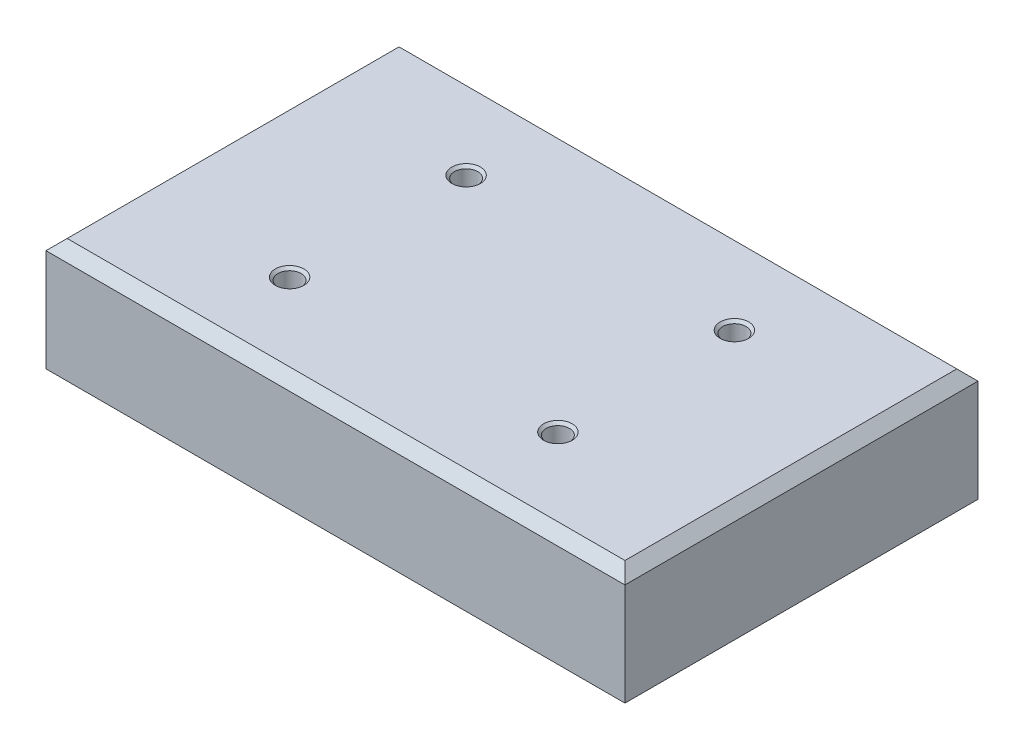
ISO-10303-21;
HEADER;
FILE_DESCRIPTION(('STEP AP214'),'2;1');
FILE_NAME('part.step','',(''),(''),'','','');
FILE_SCHEMA(('AUTOMOTIVE_DESIGN { 1 0 10303 214 1 1 1 1 }'));
ENDSEC;
DATA;
#1=APPLICATION_CONTEXT('core data for automotive mechanical design processes');
#2=APPLICATION_PROTOCOL_DEFINITION('international standard','automotive_design',2000,#1);
#3=PRODUCT_CONTEXT('',#1,'mechanical');
#4=PRODUCT('Part','Part','',(#3));
#5=PRODUCT_RELATED_PRODUCT_CATEGORY('part','',(#4));
#6=PRODUCT_DEFINITION_FORMATION('','',#4);
#7=PRODUCT_DEFINITION_CONTEXT('part definition',#1,'design');
#8=PRODUCT_DEFINITION('design','',#6,#7);
#9=PRODUCT_DEFINITION_SHAPE('','',#8);
#10=(LENGTH_UNIT() NAMED_UNIT(*) SI_UNIT(.MILLI.,.METRE.));
#11=(NAMED_UNIT(*) PLANE_ANGLE_UNIT() SI_UNIT($,.RADIAN.));
#12=(NAMED_UNIT(*) SI_UNIT($,.STERADIAN.) SOLID_ANGLE_UNIT());
#13=UNCERTAINTY_MEASURE_WITH_UNIT(LENGTH_MEASURE(1.E-05),#10,'distance_accuracy_value','');
#14=(GEOMETRIC_REPRESENTATION_CONTEXT(3) GLOBAL_UNCERTAINTY_ASSIGNED_CONTEXT((#13)) GLOBAL_UNIT_ASSIGNED_CONTEXT((#10,
#11,#12)) REPRESENTATION_CONTEXT('',''));
#15=CARTESIAN_POINT('',(0.,0.,0.));
#16=DIRECTION('',(0.,0.,1.));
#17=DIRECTION('',(1.,0.,0.));
#18=AXIS2_PLACEMENT_3D('',#15,#16,#17);
#19=CARTESIAN_POINT('',(0.,16.,0.));
#20=DIRECTION('',(1.,0.,0.));
#21=DIRECTION('',(0.,0.,-1.));
#22=AXIS2_PLACEMENT_3D('',#19,#20,#21);
#23=PLANE('',#22);
#24=DIRECTION('',(0.,-1.,0.));
#25=VECTOR('',#24,1.);
#26=CARTESIAN_POINT('',(0.,16.,0.));
#27=LINE('',#26,#25);
#28=CARTESIAN_POINT('',(0.,14.5,0.));
#29=VERTEX_POINT('',#28);
#30=CARTESIAN_POINT('',(0.,0.,0.));
#31=VERTEX_POINT('',#30);
#32=EDGE_CURVE('E175',#29,#31,#27,.T.);
#33=ORIENTED_EDGE('',*,*,#32,.F.);
#34=DIRECTION('',(0.,0.,-1.));
#35=VECTOR('',#34,1.);
#36=CARTESIAN_POINT('',(0.,14.5,0.));
#37=LINE('',#36,#35);
#38=CARTESIAN_POINT('',(0.,14.5,-50.));
#39=VERTEX_POINT('',#38);
#40=EDGE_CURVE('E186',#29,#39,#37,.T.);
#41=ORIENTED_EDGE('',*,*,#40,.T.);
#42=DIRECTION('',(0.,-1.,0.));
#43=VECTOR('',#42,1.);
#44=CARTESIAN_POINT('',(0.,16.,-50.));
#45=LINE('',#44,#43);
#46=CARTESIAN_POINT('',(0.,0.,-50.));
#47=VERTEX_POINT('',#46);
#48=EDGE_CURVE('E169',#39,#47,#45,.T.);
#49=ORIENTED_EDGE('',*,*,#48,.T.);
#50=DIRECTION('',(0.,0.,1.));
#51=VECTOR('',#50,1.);
#52=CARTESIAN_POINT('',(0.,0.,0.));
#53=LINE('',#52,#51);
#54=EDGE_CURVE('E157',#47,#31,#53,.T.);
#55=ORIENTED_EDGE('',*,*,#54,.T.);
#56=EDGE_LOOP('',(#33,#41,#49,#55));
#57=FACE_BOUND('',#56,.T.);
#58=ADVANCED_FACE('F47',(#57),#23,.F.);
#59=CARTESIAN_POINT('',(0.,16.,0.));
#60=DIRECTION('',(0.,0.,-1.));
#61=DIRECTION('',(-1.,0.,0.));
#62=AXIS2_PLACEMENT_3D('',#59,#60,#61);
#63=PLANE('',#62);
#64=DIRECTION('',(0.,-1.,0.));
#65=VECTOR('',#64,1.);
#66=CARTESIAN_POINT('',(82.,16.,0.));
#67=LINE('',#66,#65);
#68=CARTESIAN_POINT('',(82.,14.5,0.));
#69=VERTEX_POINT('',#68);
#70=CARTESIAN_POINT('',(82.,0.,0.));
#71=VERTEX_POINT('',#70);
#72=EDGE_CURVE('E173',#69,#71,#67,.T.);
#73=ORIENTED_EDGE('',*,*,#72,.F.);
#74=DIRECTION('',(-1.,0.,0.));
#75=VECTOR('',#74,1.);
#76=CARTESIAN_POINT('',(0.,14.5,0.));
#77=LINE('',#76,#75);
#78=EDGE_CURVE('E57',#69,#29,#77,.T.);
#79=ORIENTED_EDGE('',*,*,#78,.T.);
#80=ORIENTED_EDGE('',*,*,#32,.T.);
#81=DIRECTION('',(1.,0.,0.));
#82=VECTOR('',#81,1.);
#83=CARTESIAN_POINT('',(0.,0.,0.));
#84=LINE('',#83,#82);
#85=EDGE_CURVE('E160',#31,#71,#84,.T.);
#86=ORIENTED_EDGE('',*,*,#85,.T.);
#87=EDGE_LOOP('',(#73,#79,#80,#86));
#88=FACE_BOUND('',#87,.T.);
#89=ADVANCED_FACE('F211',(#88),#63,.F.);
#90=CARTESIAN_POINT('',(82.,16.,0.));
#91=DIRECTION('',(-1.,0.,0.));
#92=DIRECTION('',(0.,0.,1.));
#93=AXIS2_PLACEMENT_3D('',#90,#91,#92);
#94=PLANE('',#93);
#95=DIRECTION('',(0.,-1.,0.));
#96=VECTOR('',#95,1.);
#97=CARTESIAN_POINT('',(82.,16.,-50.));
#98=LINE('',#97,#96);
#99=CARTESIAN_POINT('',(82.,14.5,-50.));
#100=VERTEX_POINT('',#99);
#101=CARTESIAN_POINT('',(82.,0.,-50.));
#102=VERTEX_POINT('',#101);
#103=EDGE_CURVE('E171',#100,#102,#98,.T.);
#104=ORIENTED_EDGE('',*,*,#103,.F.);
#105=DIRECTION('',(0.,0.,1.));
#106=VECTOR('',#105,1.);
#107=CARTESIAN_POINT('',(82.,14.5,0.));
#108=LINE('',#107,#106);
#109=EDGE_CURVE('E11',#100,#69,#108,.T.);
#110=ORIENTED_EDGE('',*,*,#109,.T.);
#111=ORIENTED_EDGE('',*,*,#72,.T.);
#112=DIRECTION('',(0.,0.,-1.));
#113=VECTOR('',#112,1.);
#114=CARTESIAN_POINT('',(82.,0.,0.));
#115=LINE('',#114,#113);
#116=EDGE_CURVE('E163',#71,#102,#115,.T.);
#117=ORIENTED_EDGE('',*,*,#116,.T.);
#118=EDGE_LOOP('',(#104,#110,#111,#117));
#119=FACE_BOUND('',#118,.T.);
#120=ADVANCED_FACE('F234',(#119),#94,.F.);
#121=CARTESIAN_POINT('',(0.,16.,-50.));
#122=DIRECTION('',(0.,0.,1.));
#123=DIRECTION('',(1.,0.,0.));
#124=AXIS2_PLACEMENT_3D('',#121,#122,#123);
#125=PLANE('',#124);
#126=ORIENTED_EDGE('',*,*,#48,.F.);
#127=DIRECTION('',(1.,0.,0.));
#128=VECTOR('',#127,1.);
#129=CARTESIAN_POINT('',(0.,14.5,-50.));
#130=LINE('',#129,#128);
#131=EDGE_CURVE('E71',#39,#100,#130,.T.);
#132=ORIENTED_EDGE('',*,*,#131,.T.);
#133=ORIENTED_EDGE('',*,*,#103,.T.);
#134=DIRECTION('',(-1.,0.,0.));
#135=VECTOR('',#134,1.);
#136=CARTESIAN_POINT('',(0.,0.,-50.));
#137=LINE('',#136,#135);
#138=EDGE_CURVE('E166',#102,#47,#137,.T.);
#139=ORIENTED_EDGE('',*,*,#138,.T.);
#140=EDGE_LOOP('',(#126,#132,#133,#139));
#141=FACE_BOUND('',#140,.T.);
#142=ADVANCED_FACE('F223',(#141),#125,.F.);
#143=CARTESIAN_POINT('',(0.,16.,0.));
#144=DIRECTION('',(0.,-1.,0.));
#145=DIRECTION('',(0.,0.,-1.));
#146=AXIS2_PLACEMENT_3D('',#143,#144,#145);
#147=PLANE('',#146);
#148=CARTESIAN_POINT('',(22.,16.,-37.5));
#149=DIRECTION('',(0.,1.,0.));
#150=DIRECTION('',(0.,0.,1.));
#151=AXIS2_PLACEMENT_3D('',#148,#149,#150);
#152=CIRCLE('',#151,2.025);
#153=CARTESIAN_POINT('',(22.,16.,-35.475));
#154=VERTEX_POINT('',#153);
#155=EDGE_CURVE('E129',#154,#154,#152,.T.);
#156=ORIENTED_EDGE('',*,*,#155,.F.);
#157=EDGE_LOOP('',(#156));
#158=FACE_BOUND('',#157,.T.);
#159=CARTESIAN_POINT('',(22.,16.,-12.5));
#160=DIRECTION('',(0.,1.,0.));
#161=DIRECTION('',(0.,0.,1.));
#162=AXIS2_PLACEMENT_3D('',#159,#160,#161);
#163=CIRCLE('',#162,2.025);
#164=CARTESIAN_POINT('',(22.,16.,-10.475));
#165=VERTEX_POINT('',#164);
#166=EDGE_CURVE('E122',#165,#165,#163,.T.);
#167=ORIENTED_EDGE('',*,*,#166,.F.);
#168=EDGE_LOOP('',(#167));
#169=FACE_BOUND('',#168,.T.);
#170=CARTESIAN_POINT('',(60.,16.,-37.5));
#171=DIRECTION('',(0.,1.,0.));
#172=DIRECTION('',(0.,0.,1.));
#173=AXIS2_PLACEMENT_3D('',#170,#171,#172);
#174=CIRCLE('',#173,2.025);
#175=CARTESIAN_POINT('',(60.,16.,-35.475));
#176=VERTEX_POINT('',#175);
#177=EDGE_CURVE('E138',#176,#176,#174,.T.);
#178=ORIENTED_EDGE('',*,*,#177,.F.);
#179=EDGE_LOOP('',(#178));
#180=FACE_BOUND('',#179,.T.);
#181=CARTESIAN_POINT('',(60.,16.,-12.5));
#182=DIRECTION('',(0.,1.,0.));
#183=DIRECTION('',(0.,0.,1.));
#184=AXIS2_PLACEMENT_3D('',#181,#182,#183);
#185=CIRCLE('',#184,2.025);
#186=CARTESIAN_POINT('',(60.,16.,-10.475));
#187=VERTEX_POINT('',#186);
#188=EDGE_CURVE('E147',#187,#187,#185,.T.);
#189=ORIENTED_EDGE('',*,*,#188,.F.);
#190=EDGE_LOOP('',(#189));
#191=FACE_BOUND('',#190,.T.);
#192=DIRECTION('',(-1.,0.,0.));
#193=VECTOR('',#192,1.);
#194=CARTESIAN_POINT('',(0.,16.,-48.5));
#195=LINE('',#194,#193);
#196=CARTESIAN_POINT('',(80.5,16.,-48.5));
#197=VERTEX_POINT('',#196);
#198=CARTESIAN_POINT('',(1.50000000000001,16.,-48.5));
#199=VERTEX_POINT('',#198);
#200=EDGE_CURVE('E181',#197,#199,#195,.T.);
#201=ORIENTED_EDGE('',*,*,#200,.T.);
#202=DIRECTION('',(0.,0.,1.));
#203=VECTOR('',#202,1.);
#204=CARTESIAN_POINT('',(1.50000000000002,16.,0.));
#205=LINE('',#204,#203);
#206=CARTESIAN_POINT('',(1.50000000000002,16.,-1.50000000000002));
#207=VERTEX_POINT('',#206);
#208=EDGE_CURVE('E183',#199,#207,#205,.T.);
#209=ORIENTED_EDGE('',*,*,#208,.T.);
#210=DIRECTION('',(1.,0.,0.));
#211=VECTOR('',#210,1.);
#212=CARTESIAN_POINT('',(0.,16.,-1.50000000000002));
#213=LINE('',#212,#211);
#214=CARTESIAN_POINT('',(80.5,16.,-1.50000000000002));
#215=VERTEX_POINT('',#214);
#216=EDGE_CURVE('E179',#207,#215,#213,.T.);
#217=ORIENTED_EDGE('',*,*,#216,.T.);
#218=DIRECTION('',(0.,0.,-1.));
#219=VECTOR('',#218,1.);
#220=CARTESIAN_POINT('',(80.5,16.,0.));
#221=LINE('',#220,#219);
#222=EDGE_CURVE('E177',#215,#197,#221,.T.);
#223=ORIENTED_EDGE('',*,*,#222,.T.);
#224=EDGE_LOOP('',(#201,#209,#217,#223));
#225=FACE_BOUND('',#224,.T.);
#226=ADVANCED_FACE('F220',(#158,#169,#180,#191,#225),#147,.F.);
#227=CARTESIAN_POINT('',(0.,0.,0.));
#228=DIRECTION('',(0.,-1.,0.));
#229=DIRECTION('',(0.,0.,-1.));
#230=AXIS2_PLACEMENT_3D('',#227,#228,#229);
#231=PLANE('',#230);
#232=ORIENTED_EDGE('',*,*,#54,.F.);
#233=ORIENTED_EDGE('',*,*,#138,.F.);
#234=ORIENTED_EDGE('',*,*,#116,.F.);
#235=ORIENTED_EDGE('',*,*,#85,.F.);
#236=EDGE_LOOP('',(#232,#233,#234,#235));
#237=FACE_BOUND('',#236,.T.);
#238=ADVANCED_FACE('F222',(#237),#231,.T.);
#239=CARTESIAN_POINT('',(80.5,16.,0.));
#240=DIRECTION('',(-0.707106781186544,-0.707106781186551,0.));
#241=DIRECTION('',(0.,0.,-1.));
#242=AXIS2_PLACEMENT_3D('',#239,#240,#241);
#243=PLANE('',#242);
#244=DIRECTION('',(0.577350269189628,-0.577350269189622,0.577350269189628));
#245=VECTOR('',#244,1.);
#246=CARTESIAN_POINT('',(81.,15.5,-1.00000000000001));
#247=LINE('',#246,#245);
#248=EDGE_CURVE('E193',#69,#215,#247,.F.);
#249=ORIENTED_EDGE('',*,*,#248,.F.);
#250=ORIENTED_EDGE('',*,*,#109,.F.);
#251=DIRECTION('',(-0.577350269189628,0.577350269189622,0.577350269189628));
#252=VECTOR('',#251,1.);
#253=CARTESIAN_POINT('',(64.3333333333332,32.1666666666666,-32.3333333333332));
#254=LINE('',#253,#252);
#255=EDGE_CURVE('E52',#197,#100,#254,.F.);
#256=ORIENTED_EDGE('',*,*,#255,.F.);
#257=ORIENTED_EDGE('',*,*,#222,.F.);
#258=EDGE_LOOP('',(#249,#250,#256,#257));
#259=FACE_BOUND('',#258,.T.);
#260=ADVANCED_FACE('F50',(#259),#243,.F.);
#261=CARTESIAN_POINT('',(0.,16.,-48.5));
#262=DIRECTION('',(0.,-0.707106781186551,0.707106781186544));
#263=DIRECTION('',(-1.,0.,0.));
#264=AXIS2_PLACEMENT_3D('',#261,#262,#263);
#265=PLANE('',#264);
#266=ORIENTED_EDGE('',*,*,#255,.T.);
#267=ORIENTED_EDGE('',*,*,#131,.F.);
#268=DIRECTION('',(0.577350269189628,0.577350269189622,0.577350269189628));
#269=VECTOR('',#268,1.);
#270=CARTESIAN_POINT('',(1.,15.5,-49.));
#271=LINE('',#270,#269);
#272=EDGE_CURVE('E192',#199,#39,#271,.F.);
#273=ORIENTED_EDGE('',*,*,#272,.F.);
#274=ORIENTED_EDGE('',*,*,#200,.F.);
#275=EDGE_LOOP('',(#266,#267,#273,#274));
#276=FACE_BOUND('',#275,.T.);
#277=ADVANCED_FACE('F203',(#276),#265,.F.);
#278=CARTESIAN_POINT('',(0.,16.,-1.50000000000002));
#279=DIRECTION('',(0.,-0.707106781186551,-0.707106781186544));
#280=DIRECTION('',(1.,0.,0.));
#281=AXIS2_PLACEMENT_3D('',#278,#279,#280);
#282=PLANE('',#281);
#283=ORIENTED_EDGE('',*,*,#248,.T.);
#284=ORIENTED_EDGE('',*,*,#216,.F.);
#285=DIRECTION('',(-0.577350269189628,-0.577350269189622,0.577350269189628));
#286=VECTOR('',#285,1.);
#287=CARTESIAN_POINT('',(1.00000000000001,15.5,-1.00000000000001));
#288=LINE('',#287,#286);
#289=EDGE_CURVE('E156',#29,#207,#288,.F.);
#290=ORIENTED_EDGE('',*,*,#289,.F.);
#291=ORIENTED_EDGE('',*,*,#78,.F.);
#292=EDGE_LOOP('',(#283,#284,#290,#291));
#293=FACE_BOUND('',#292,.T.);
#294=ADVANCED_FACE('F208',(#293),#282,.F.);
#295=CARTESIAN_POINT('',(1.50000000000002,16.,0.));
#296=DIRECTION('',(0.707106781186544,-0.707106781186551,0.));
#297=DIRECTION('',(0.,0.,1.));
#298=AXIS2_PLACEMENT_3D('',#295,#296,#297);
#299=PLANE('',#298);
#300=ORIENTED_EDGE('',*,*,#272,.T.);
#301=ORIENTED_EDGE('',*,*,#40,.F.);
#302=ORIENTED_EDGE('',*,*,#289,.T.);
#303=ORIENTED_EDGE('',*,*,#208,.F.);
#304=EDGE_LOOP('',(#300,#301,#302,#303));
#305=FACE_BOUND('',#304,.T.);
#306=ADVANCED_FACE('F217',(#305),#299,.F.);
#307=CARTESIAN_POINT('',(60.,8.99142002139548,-12.5));
#308=DIRECTION('',(0.,1.,0.));
#309=DIRECTION('',(0.,0.,1.));
#310=AXIS2_PLACEMENT_3D('',#307,#308,#309);
#311=CONICAL_SURFACE('',#310,1.65,1.02974425867665);
#312=CARTESIAN_POINT('',(60.,8.,-12.5));
#313=VERTEX_POINT('',#312);
#314=VERTEX_LOOP('',#313);
#315=FACE_BOUND('',#314,.T.);
#316=CARTESIAN_POINT('',(60.,8.99142002139548,-12.5));
#317=DIRECTION('',(0.,1.,0.));
#318=DIRECTION('',(0.,0.,1.));
#319=AXIS2_PLACEMENT_3D('',#316,#317,#318);
#320=CIRCLE('',#319,1.65);
#321=CARTESIAN_POINT('',(60.,8.99142002139548,-10.85));
#322=VERTEX_POINT('',#321);
#323=EDGE_CURVE('E153',#322,#322,#320,.T.);
#324=ORIENTED_EDGE('',*,*,#323,.T.);
#325=EDGE_LOOP('',(#324));
#326=FACE_BOUND('',#325,.T.);
#327=ADVANCED_FACE('F252',(#315,#326),#311,.F.);
#328=CARTESIAN_POINT('',(60.,16.,-12.5));
#329=DIRECTION('',(0.,1.,0.));
#330=DIRECTION('',(0.,0.,1.));
#331=AXIS2_PLACEMENT_3D('',#328,#329,#330);
#332=CYLINDRICAL_SURFACE('',#331,1.65);
#333=ORIENTED_EDGE('',*,*,#323,.F.);
#334=EDGE_LOOP('',(#333));
#335=FACE_BOUND('',#334,.T.);
#336=CARTESIAN_POINT('',(60.,15.625,-12.5));
#337=DIRECTION('',(0.,1.,0.));
#338=DIRECTION('',(0.,0.,1.));
#339=AXIS2_PLACEMENT_3D('',#336,#337,#338);
#340=CIRCLE('',#339,1.65);
#341=CARTESIAN_POINT('',(60.,15.625,-10.85));
#342=VERTEX_POINT('',#341);
#343=EDGE_CURVE('E150',#342,#342,#340,.T.);
#344=ORIENTED_EDGE('',*,*,#343,.T.);
#345=EDGE_LOOP('',(#344));
#346=FACE_BOUND('',#345,.T.);
#347=ADVANCED_FACE('F304',(#335,#346),#332,.F.);
#348=CARTESIAN_POINT('',(60.,16.,-12.5));
#349=DIRECTION('',(0.,1.,0.));
#350=DIRECTION('',(0.,0.,1.));
#351=AXIS2_PLACEMENT_3D('',#348,#349,#350);
#352=CONICAL_SURFACE('',#351,2.025,0.785398163397448);
#353=ORIENTED_EDGE('',*,*,#343,.F.);
#354=EDGE_LOOP('',(#353));
#355=FACE_BOUND('',#354,.T.);
#356=ORIENTED_EDGE('',*,*,#188,.T.);
#357=EDGE_LOOP('',(#356));
#358=FACE_BOUND('',#357,.T.);
#359=ADVANCED_FACE('F312',(#355,#358),#352,.F.);
#360=CARTESIAN_POINT('',(60.,8.99142002139548,-37.5));
#361=DIRECTION('',(0.,1.,0.));
#362=DIRECTION('',(0.,0.,1.));
#363=AXIS2_PLACEMENT_3D('',#360,#361,#362);
#364=CONICAL_SURFACE('',#363,1.65,1.02974425867665);
#365=CARTESIAN_POINT('',(60.,8.,-37.5));
#366=VERTEX_POINT('',#365);
#367=VERTEX_LOOP('',#366);
#368=FACE_BOUND('',#367,.T.);
#369=CARTESIAN_POINT('',(60.,8.99142002139548,-37.5));
#370=DIRECTION('',(0.,1.,0.));
#371=DIRECTION('',(0.,0.,1.));
#372=AXIS2_PLACEMENT_3D('',#369,#370,#371);
#373=CIRCLE('',#372,1.65);
#374=CARTESIAN_POINT('',(60.,8.99142002139548,-35.85));
#375=VERTEX_POINT('',#374);
#376=EDGE_CURVE('E144',#375,#375,#373,.T.);
#377=ORIENTED_EDGE('',*,*,#376,.T.);
#378=EDGE_LOOP('',(#377));
#379=FACE_BOUND('',#378,.T.);
#380=ADVANCED_FACE('F322',(#368,#379),#364,.F.);
#381=CARTESIAN_POINT('',(60.,16.,-37.5));
#382=DIRECTION('',(0.,1.,0.));
#383=DIRECTION('',(0.,0.,1.));
#384=AXIS2_PLACEMENT_3D('',#381,#382,#383);
#385=CYLINDRICAL_SURFACE('',#384,1.65);
#386=ORIENTED_EDGE('',*,*,#376,.F.);
#387=EDGE_LOOP('',(#386));
#388=FACE_BOUND('',#387,.T.);
#389=CARTESIAN_POINT('',(60.,15.625,-37.5));
#390=DIRECTION('',(0.,1.,0.));
#391=DIRECTION('',(0.,0.,1.));
#392=AXIS2_PLACEMENT_3D('',#389,#390,#391);
#393=CIRCLE('',#392,1.65);
#394=CARTESIAN_POINT('',(60.,15.625,-35.85));
#395=VERTEX_POINT('',#394);
#396=EDGE_CURVE('E141',#395,#395,#393,.T.);
#397=ORIENTED_EDGE('',*,*,#396,.T.);
#398=EDGE_LOOP('',(#397));
#399=FACE_BOUND('',#398,.T.);
#400=ADVANCED_FACE('F330',(#388,#399),#385,.F.);
#401=CARTESIAN_POINT('',(60.,16.,-37.5));
#402=DIRECTION('',(0.,1.,0.));
#403=DIRECTION('',(0.,0.,1.));
#404=AXIS2_PLACEMENT_3D('',#401,#402,#403);
#405=CONICAL_SURFACE('',#404,2.025,0.785398163397448);
#406=ORIENTED_EDGE('',*,*,#396,.F.);
#407=EDGE_LOOP('',(#406));
#408=FACE_BOUND('',#407,.T.);
#409=ORIENTED_EDGE('',*,*,#177,.T.);
#410=EDGE_LOOP('',(#409));
#411=FACE_BOUND('',#410,.T.);
#412=ADVANCED_FACE('F339',(#408,#411),#405,.F.);
#413=CARTESIAN_POINT('',(22.,8.99142002139548,-12.5));
#414=DIRECTION('',(0.,1.,0.));
#415=DIRECTION('',(0.,0.,1.));
#416=AXIS2_PLACEMENT_3D('',#413,#414,#415);
#417=CONICAL_SURFACE('',#416,1.65,1.02974425867665);
#418=CARTESIAN_POINT('',(22.,8.,-12.5));
#419=VERTEX_POINT('',#418);
#420=VERTEX_LOOP('',#419);
#421=FACE_BOUND('',#420,.T.);
#422=CARTESIAN_POINT('',(22.,8.99142002139548,-12.5));
#423=DIRECTION('',(0.,1.,0.));
#424=DIRECTION('',(0.,0.,1.));
#425=AXIS2_PLACEMENT_3D('',#422,#423,#424);
#426=CIRCLE('',#425,1.65);
#427=CARTESIAN_POINT('',(22.,8.99142002139548,-10.85));
#428=VERTEX_POINT('',#427);
#429=EDGE_CURVE('E135',#428,#428,#426,.T.);
#430=ORIENTED_EDGE('',*,*,#429,.T.);
#431=EDGE_LOOP('',(#430));
#432=FACE_BOUND('',#431,.T.);
#433=ADVANCED_FACE('F349',(#421,#432),#417,.F.);
#434=CARTESIAN_POINT('',(22.,16.,-12.5));
#435=DIRECTION('',(0.,1.,0.));
#436=DIRECTION('',(0.,0.,1.));
#437=AXIS2_PLACEMENT_3D('',#434,#435,#436);
#438=CYLINDRICAL_SURFACE('',#437,1.65);
#439=ORIENTED_EDGE('',*,*,#429,.F.);
#440=EDGE_LOOP('',(#439));
#441=FACE_BOUND('',#440,.T.);
#442=CARTESIAN_POINT('',(22.,15.625,-12.5));
#443=DIRECTION('',(0.,1.,0.));
#444=DIRECTION('',(0.,0.,1.));
#445=AXIS2_PLACEMENT_3D('',#442,#443,#444);
#446=CIRCLE('',#445,1.65);
#447=CARTESIAN_POINT('',(22.,15.625,-10.85));
#448=VERTEX_POINT('',#447);
#449=EDGE_CURVE('E126',#448,#448,#446,.T.);
#450=ORIENTED_EDGE('',*,*,#449,.T.);
#451=EDGE_LOOP('',(#450));
#452=FACE_BOUND('',#451,.T.);
#453=ADVANCED_FACE('F357',(#441,#452),#438,.F.);
#454=CARTESIAN_POINT('',(22.,16.,-12.5));
#455=DIRECTION('',(0.,1.,0.));
#456=DIRECTION('',(0.,0.,1.));
#457=AXIS2_PLACEMENT_3D('',#454,#455,#456);
#458=CONICAL_SURFACE('',#457,2.025,0.785398163397448);
#459=ORIENTED_EDGE('',*,*,#449,.F.);
#460=EDGE_LOOP('',(#459));
#461=FACE_BOUND('',#460,.T.);
#462=ORIENTED_EDGE('',*,*,#166,.T.);
#463=EDGE_LOOP('',(#462));
#464=FACE_BOUND('',#463,.T.);
#465=ADVANCED_FACE('F116',(#461,#464),#458,.F.);
#466=CARTESIAN_POINT('',(22.,8.99142002139548,-37.5));
#467=DIRECTION('',(0.,1.,0.));
#468=DIRECTION('',(0.,0.,1.));
#469=AXIS2_PLACEMENT_3D('',#466,#467,#468);
#470=CONICAL_SURFACE('',#469,1.65,1.02974425867665);
#471=CARTESIAN_POINT('',(22.,8.,-37.5));
#472=VERTEX_POINT('',#471);
#473=VERTEX_LOOP('',#472);
#474=FACE_BOUND('',#473,.T.);
#475=CARTESIAN_POINT('',(22.,8.99142002139548,-37.5));
#476=DIRECTION('',(0.,1.,0.));
#477=DIRECTION('',(0.,0.,1.));
#478=AXIS2_PLACEMENT_3D('',#475,#476,#477);
#479=CIRCLE('',#478,1.65);
#480=CARTESIAN_POINT('',(22.,8.99142002139548,-35.85));
#481=VERTEX_POINT('',#480);
#482=EDGE_CURVE('E120',#481,#481,#479,.T.);
#483=ORIENTED_EDGE('',*,*,#482,.T.);
#484=EDGE_LOOP('',(#483));
#485=FACE_BOUND('',#484,.T.);
#486=ADVANCED_FACE('F112',(#474,#485),#470,.F.);
#487=CARTESIAN_POINT('',(22.,16.,-37.5));
#488=DIRECTION('',(0.,1.,0.));
#489=DIRECTION('',(0.,0.,1.));
#490=AXIS2_PLACEMENT_3D('',#487,#488,#489);
#491=CYLINDRICAL_SURFACE('',#490,1.65);
#492=ORIENTED_EDGE('',*,*,#482,.F.);
#493=EDGE_LOOP('',(#492));
#494=FACE_BOUND('',#493,.T.);
#495=CARTESIAN_POINT('',(22.,15.625,-37.5));
#496=DIRECTION('',(0.,1.,0.));
#497=DIRECTION('',(0.,0.,1.));
#498=AXIS2_PLACEMENT_3D('',#495,#496,#497);
#499=CIRCLE('',#498,1.65);
#500=CARTESIAN_POINT('',(22.,15.625,-35.85));
#501=VERTEX_POINT('',#500);
#502=EDGE_CURVE('E123',#501,#501,#499,.T.);
#503=ORIENTED_EDGE('',*,*,#502,.T.);
#504=EDGE_LOOP('',(#503));
#505=FACE_BOUND('',#504,.T.);
#506=ADVANCED_FACE('F115',(#494,#505),#491,.F.);
#507=CARTESIAN_POINT('',(22.,16.,-37.5));
#508=DIRECTION('',(0.,1.,0.));
#509=DIRECTION('',(0.,0.,1.));
#510=AXIS2_PLACEMENT_3D('',#507,#508,#509);
#511=CONICAL_SURFACE('',#510,2.025,0.785398163397448);
#512=ORIENTED_EDGE('',*,*,#502,.F.);
#513=EDGE_LOOP('',(#512));
#514=FACE_BOUND('',#513,.T.);
#515=ORIENTED_EDGE('',*,*,#155,.T.);
#516=EDGE_LOOP('',(#515));
#517=FACE_BOUND('',#516,.T.);
#518=ADVANCED_FACE('F387',(#514,#517),#511,.F.);
#519=CLOSED_SHELL('',(#58,#89,#120,#142,#226,#238,#260,#277,#294,#306,#327,#347,#359,#380,#400,
#412,#433,#453,#465,#486,#506,#518));
#520=MANIFOLD_SOLID_BREP('B2',#519);
#521=ADVANCED_BREP_SHAPE_REPRESENTATION('',(#18,#520),#14);
#522=SHAPE_DEFINITION_REPRESENTATION(#9,#521);
ENDSEC;
END-ISO-10303-21;
